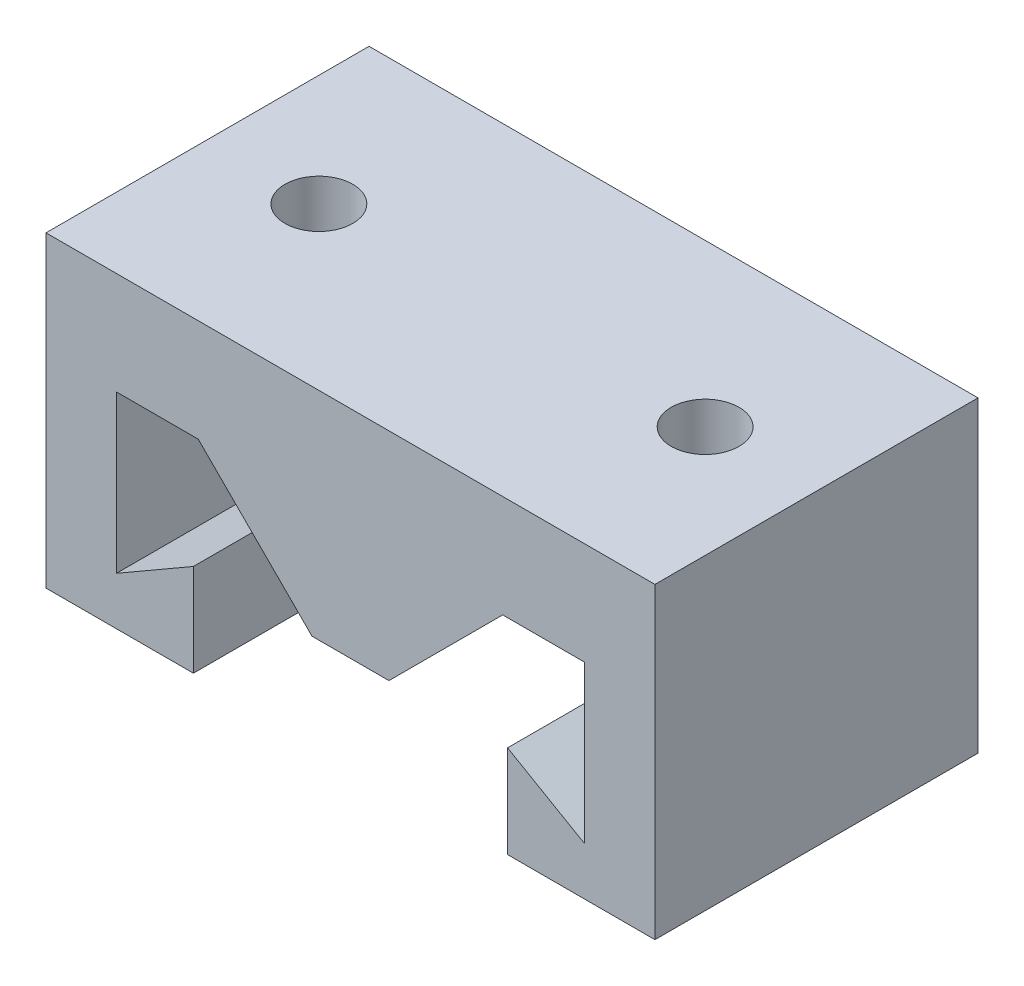
ISO-10303-21;
HEADER;
FILE_DESCRIPTION(('STEP AP214'),'2;1');
FILE_NAME('part.step','',(''),(''),'','','');
FILE_SCHEMA(('AUTOMOTIVE_DESIGN { 1 0 10303 214 1 1 1 1 }'));
ENDSEC;
DATA;
#1=APPLICATION_CONTEXT('core data for automotive mechanical design processes');
#2=APPLICATION_PROTOCOL_DEFINITION('international standard','automotive_design',2000,#1);
#3=PRODUCT_CONTEXT('',#1,'mechanical');
#4=PRODUCT('Part','Part','',(#3));
#5=PRODUCT_RELATED_PRODUCT_CATEGORY('part','',(#4));
#6=PRODUCT_DEFINITION_FORMATION('','',#4);
#7=PRODUCT_DEFINITION_CONTEXT('part definition',#1,'design');
#8=PRODUCT_DEFINITION('design','',#6,#7);
#9=PRODUCT_DEFINITION_SHAPE('','',#8);
#10=(LENGTH_UNIT() NAMED_UNIT(*) SI_UNIT(.MILLI.,.METRE.));
#11=(NAMED_UNIT(*) PLANE_ANGLE_UNIT() SI_UNIT($,.RADIAN.));
#12=(NAMED_UNIT(*) SI_UNIT($,.STERADIAN.) SOLID_ANGLE_UNIT());
#13=UNCERTAINTY_MEASURE_WITH_UNIT(LENGTH_MEASURE(1.E-05),#10,'distance_accuracy_value','');
#14=(GEOMETRIC_REPRESENTATION_CONTEXT(3) GLOBAL_UNCERTAINTY_ASSIGNED_CONTEXT((#13)) GLOBAL_UNIT_ASSIGNED_CONTEXT((#10,
#11,#12)) REPRESENTATION_CONTEXT('',''));
#15=CARTESIAN_POINT('',(0.,0.,0.));
#16=DIRECTION('',(0.,0.,1.));
#17=DIRECTION('',(1.,0.,0.));
#18=AXIS2_PLACEMENT_3D('',#15,#16,#17);
#19=CARTESIAN_POINT('',(-19.05,0.,10.));
#20=DIRECTION('',(0.,1.,0.));
#21=DIRECTION('',(-1.,0.,0.));
#22=AXIS2_PLACEMENT_3D('',#19,#20,#21);
#23=PLANE('',#22);
#24=DIRECTION('',(1.,0.,0.));
#25=VECTOR('',#24,1.);
#26=CARTESIAN_POINT('',(-19.05,0.,10.));
#27=LINE('',#26,#25);
#28=CARTESIAN_POINT('',(-18.85,0.,10.));
#29=VERTEX_POINT('',#28);
#30=CARTESIAN_POINT('',(-9.72500000000002,0.,10.));
#31=VERTEX_POINT('',#30);
#32=EDGE_CURVE('E158',#29,#31,#27,.T.);
#33=ORIENTED_EDGE('',*,*,#32,.F.);
#34=DIRECTION('',(0.,0.,1.));
#35=VECTOR('',#34,1.);
#36=CARTESIAN_POINT('',(-18.85,0.,-10.));
#37=LINE('',#36,#35);
#38=CARTESIAN_POINT('',(-18.85,0.,-10.));
#39=VERTEX_POINT('',#38);
#40=EDGE_CURVE('E146',#39,#29,#37,.T.);
#41=ORIENTED_EDGE('',*,*,#40,.F.);
#42=DIRECTION('',(1.,0.,0.));
#43=VECTOR('',#42,1.);
#44=CARTESIAN_POINT('',(-19.05,0.,-10.));
#45=LINE('',#44,#43);
#46=CARTESIAN_POINT('',(-9.72500000000002,0.,-10.));
#47=VERTEX_POINT('',#46);
#48=EDGE_CURVE('E202',#39,#47,#45,.T.);
#49=ORIENTED_EDGE('',*,*,#48,.T.);
#50=DIRECTION('',(0.,0.,-1.));
#51=VECTOR('',#50,1.);
#52=CARTESIAN_POINT('',(-9.72500000000002,0.,10.));
#53=LINE('',#52,#51);
#54=EDGE_CURVE('E11',#31,#47,#53,.T.);
#55=ORIENTED_EDGE('',*,*,#54,.F.);
#56=EDGE_LOOP('',(#33,#41,#49,#55));
#57=FACE_BOUND('',#56,.T.);
#58=ADVANCED_FACE('F36',(#57),#23,.F.);
#59=CARTESIAN_POINT('',(-9.72500000000002,0.,10.));
#60=DIRECTION('',(-1.,0.,0.));
#61=DIRECTION('',(0.,-1.,0.));
#62=AXIS2_PLACEMENT_3D('',#59,#60,#61);
#63=PLANE('',#62);
#64=DIRECTION('',(0.,1.,0.));
#65=VECTOR('',#64,1.);
#66=CARTESIAN_POINT('',(-9.72500000000002,0.,-10.));
#67=LINE('',#66,#65);
#68=CARTESIAN_POINT('',(-9.72500000000001,5.72463065701563,-10.));
#69=VERTEX_POINT('',#68);
#70=EDGE_CURVE('E204',#47,#69,#67,.T.);
#71=ORIENTED_EDGE('',*,*,#70,.T.);
#72=DIRECTION('',(0.,0.,-1.));
#73=VECTOR('',#72,1.);
#74=CARTESIAN_POINT('',(-9.72500000000001,5.72463065701563,10.));
#75=LINE('',#74,#73);
#76=CARTESIAN_POINT('',(-9.72500000000001,5.72463065701563,10.));
#77=VERTEX_POINT('',#76);
#78=EDGE_CURVE('E43',#77,#69,#75,.T.);
#79=ORIENTED_EDGE('',*,*,#78,.F.);
#80=DIRECTION('',(0.,1.,0.));
#81=VECTOR('',#80,1.);
#82=CARTESIAN_POINT('',(-9.72500000000002,0.,10.));
#83=LINE('',#82,#81);
#84=EDGE_CURVE('E166',#31,#77,#83,.T.);
#85=ORIENTED_EDGE('',*,*,#84,.F.);
#86=ORIENTED_EDGE('',*,*,#54,.T.);
#87=EDGE_LOOP('',(#71,#79,#85,#86));
#88=FACE_BOUND('',#87,.T.);
#89=ADVANCED_FACE('F281',(#88),#63,.F.);
#90=CARTESIAN_POINT('',(-9.72500000000001,5.72463065701563,10.));
#91=DIRECTION('',(0.500000000000004,-0.866025403784436,0.));
#92=DIRECTION('',(0.866025403784436,0.500000000000004,0.));
#93=AXIS2_PLACEMENT_3D('',#90,#91,#92);
#94=PLANE('',#93);
#95=DIRECTION('',(-0.866025403784436,-0.500000000000004,0.));
#96=VECTOR('',#95,1.);
#97=CARTESIAN_POINT('',(-9.72500000000001,5.72463065701563,-10.));
#98=LINE('',#97,#96);
#99=CARTESIAN_POINT('',(-14.4875,2.975,-10.));
#100=VERTEX_POINT('',#99);
#101=EDGE_CURVE('E207',#69,#100,#98,.T.);
#102=ORIENTED_EDGE('',*,*,#101,.T.);
#103=DIRECTION('',(0.,0.,-1.));
#104=VECTOR('',#103,1.);
#105=CARTESIAN_POINT('',(-14.4875,2.975,10.));
#106=LINE('',#105,#104);
#107=CARTESIAN_POINT('',(-14.4875,2.975,10.));
#108=VERTEX_POINT('',#107);
#109=EDGE_CURVE('E255',#108,#100,#106,.T.);
#110=ORIENTED_EDGE('',*,*,#109,.F.);
#111=DIRECTION('',(-0.866025403784436,-0.500000000000004,0.));
#112=VECTOR('',#111,1.);
#113=CARTESIAN_POINT('',(-9.72500000000001,5.72463065701563,10.));
#114=LINE('',#113,#112);
#115=EDGE_CURVE('E169',#77,#108,#114,.T.);
#116=ORIENTED_EDGE('',*,*,#115,.F.);
#117=ORIENTED_EDGE('',*,*,#78,.T.);
#118=EDGE_LOOP('',(#102,#110,#116,#117));
#119=FACE_BOUND('',#118,.T.);
#120=ADVANCED_FACE('F262',(#119),#94,.F.);
#121=CARTESIAN_POINT('',(-14.4875,2.975,10.));
#122=DIRECTION('',(-1.,0.,0.));
#123=DIRECTION('',(0.,0.,1.));
#124=AXIS2_PLACEMENT_3D('',#121,#122,#123);
#125=PLANE('',#124);
#126=DIRECTION('',(0.,1.,0.));
#127=VECTOR('',#126,1.);
#128=CARTESIAN_POINT('',(-14.4875,2.975,-10.));
#129=LINE('',#128,#127);
#130=CARTESIAN_POINT('',(-14.4875,12.7,-10.));
#131=VERTEX_POINT('',#130);
#132=EDGE_CURVE('E209',#100,#131,#129,.T.);
#133=ORIENTED_EDGE('',*,*,#132,.T.);
#134=DIRECTION('',(0.,0.,-1.));
#135=VECTOR('',#134,1.);
#136=CARTESIAN_POINT('',(-14.4875,12.7,10.));
#137=LINE('',#136,#135);
#138=CARTESIAN_POINT('',(-14.4875,12.7,10.));
#139=VERTEX_POINT('',#138);
#140=EDGE_CURVE('E252',#139,#131,#137,.T.);
#141=ORIENTED_EDGE('',*,*,#140,.F.);
#142=DIRECTION('',(0.,1.,0.));
#143=VECTOR('',#142,1.);
#144=CARTESIAN_POINT('',(-14.4875,2.975,10.));
#145=LINE('',#144,#143);
#146=EDGE_CURVE('E179',#108,#139,#145,.T.);
#147=ORIENTED_EDGE('',*,*,#146,.F.);
#148=ORIENTED_EDGE('',*,*,#109,.T.);
#149=EDGE_LOOP('',(#133,#141,#147,#148));
#150=FACE_BOUND('',#149,.T.);
#151=ADVANCED_FACE('F273',(#150),#125,.F.);
#152=CARTESIAN_POINT('',(-14.4875,12.7,10.));
#153=DIRECTION('',(0.,1.,0.));
#154=DIRECTION('',(0.,0.,1.));
#155=AXIS2_PLACEMENT_3D('',#152,#153,#154);
#156=PLANE('',#155);
#157=CARTESIAN_POINT('',(-11.95625,12.7,0.));
#158=DIRECTION('',(0.,1.,0.));
#159=DIRECTION('',(0.,0.,1.));
#160=AXIS2_PLACEMENT_3D('',#157,#158,#159);
#161=CIRCLE('',#160,2.1);
#162=CARTESIAN_POINT('',(-11.95625,12.7,2.1));
#163=VERTEX_POINT('',#162);
#164=EDGE_CURVE('E205',#163,#163,#161,.F.);
#165=ORIENTED_EDGE('',*,*,#164,.F.);
#166=EDGE_LOOP('',(#165));
#167=FACE_BOUND('',#166,.T.);
#168=DIRECTION('',(1.,0.,0.));
#169=VECTOR('',#168,1.);
#170=CARTESIAN_POINT('',(-14.4875,12.7,-10.));
#171=LINE('',#170,#169);
#172=CARTESIAN_POINT('',(-9.425,12.7,-10.));
#173=VERTEX_POINT('',#172);
#174=EDGE_CURVE('E211',#131,#173,#171,.T.);
#175=ORIENTED_EDGE('',*,*,#174,.T.);
#176=DIRECTION('',(0.,0.,-1.));
#177=VECTOR('',#176,1.);
#178=CARTESIAN_POINT('',(-9.425,12.7,10.));
#179=LINE('',#178,#177);
#180=CARTESIAN_POINT('',(-9.425,12.7,10.));
#181=VERTEX_POINT('',#180);
#182=EDGE_CURVE('E249',#181,#173,#179,.T.);
#183=ORIENTED_EDGE('',*,*,#182,.F.);
#184=DIRECTION('',(1.,0.,0.));
#185=VECTOR('',#184,1.);
#186=CARTESIAN_POINT('',(-14.4875,12.7,10.));
#187=LINE('',#186,#185);
#188=EDGE_CURVE('E181',#139,#181,#187,.T.);
#189=ORIENTED_EDGE('',*,*,#188,.F.);
#190=ORIENTED_EDGE('',*,*,#140,.T.);
#191=EDGE_LOOP('',(#175,#183,#189,#190));
#192=FACE_BOUND('',#191,.T.);
#193=ADVANCED_FACE('F277',(#167,#192),#156,.F.);
#194=CARTESIAN_POINT('',(-9.425,12.7,10.));
#195=DIRECTION('',(0.707106781186549,0.707106781186546,0.));
#196=DIRECTION('',(-0.707106781186546,0.707106781186549,0.));
#197=AXIS2_PLACEMENT_3D('',#194,#195,#196);
#198=PLANE('',#197);
#199=DIRECTION('',(0.707106781186546,-0.707106781186549,0.));
#200=VECTOR('',#199,1.);
#201=CARTESIAN_POINT('',(-9.425,12.7,-10.));
#202=LINE('',#201,#200);
#203=CARTESIAN_POINT('',(-2.38125,5.65624999999998,-10.));
#204=VERTEX_POINT('',#203);
#205=EDGE_CURVE('E213',#173,#204,#202,.T.);
#206=ORIENTED_EDGE('',*,*,#205,.T.);
#207=DIRECTION('',(0.,0.,-1.));
#208=VECTOR('',#207,1.);
#209=CARTESIAN_POINT('',(-2.38125,5.65624999999998,10.));
#210=LINE('',#209,#208);
#211=CARTESIAN_POINT('',(-2.38125,5.65624999999998,10.));
#212=VERTEX_POINT('',#211);
#213=EDGE_CURVE('E246',#212,#204,#210,.T.);
#214=ORIENTED_EDGE('',*,*,#213,.F.);
#215=DIRECTION('',(0.707106781186546,-0.707106781186549,0.));
#216=VECTOR('',#215,1.);
#217=CARTESIAN_POINT('',(-9.425,12.7,10.));
#218=LINE('',#217,#216);
#219=EDGE_CURVE('E183',#181,#212,#218,.T.);
#220=ORIENTED_EDGE('',*,*,#219,.F.);
#221=ORIENTED_EDGE('',*,*,#182,.T.);
#222=EDGE_LOOP('',(#206,#214,#220,#221));
#223=FACE_BOUND('',#222,.T.);
#224=ADVANCED_FACE('F294',(#223),#198,.F.);
#225=CARTESIAN_POINT('',(-2.38125,5.65624999999998,10.));
#226=DIRECTION('',(0.,1.,0.));
#227=DIRECTION('',(0.,0.,1.));
#228=AXIS2_PLACEMENT_3D('',#225,#226,#227);
#229=PLANE('',#228);
#230=DIRECTION('',(1.,0.,0.));
#231=VECTOR('',#230,1.);
#232=CARTESIAN_POINT('',(-2.38125,5.65624999999998,-10.));
#233=LINE('',#232,#231);
#234=CARTESIAN_POINT('',(2.38125,5.65624999999998,-10.));
#235=VERTEX_POINT('',#234);
#236=EDGE_CURVE('E215',#204,#235,#233,.T.);
#237=ORIENTED_EDGE('',*,*,#236,.T.);
#238=DIRECTION('',(0.,0.,-1.));
#239=VECTOR('',#238,1.);
#240=CARTESIAN_POINT('',(2.38125,5.65624999999998,10.));
#241=LINE('',#240,#239);
#242=CARTESIAN_POINT('',(2.38125,5.65624999999998,10.));
#243=VERTEX_POINT('',#242);
#244=EDGE_CURVE('E243',#243,#235,#241,.T.);
#245=ORIENTED_EDGE('',*,*,#244,.F.);
#246=DIRECTION('',(1.,0.,0.));
#247=VECTOR('',#246,1.);
#248=CARTESIAN_POINT('',(-2.38125,5.65624999999998,10.));
#249=LINE('',#248,#247);
#250=EDGE_CURVE('E185',#212,#243,#249,.T.);
#251=ORIENTED_EDGE('',*,*,#250,.F.);
#252=ORIENTED_EDGE('',*,*,#213,.T.);
#253=EDGE_LOOP('',(#237,#245,#251,#252));
#254=FACE_BOUND('',#253,.T.);
#255=ADVANCED_FACE('F298',(#254),#229,.F.);
#256=CARTESIAN_POINT('',(2.38125,5.65624999999998,10.));
#257=DIRECTION('',(-0.707106781186549,0.707106781186546,0.));
#258=DIRECTION('',(-0.707106781186546,-0.707106781186549,0.));
#259=AXIS2_PLACEMENT_3D('',#256,#257,#258);
#260=PLANE('',#259);
#261=DIRECTION('',(0.707106781186546,0.707106781186549,0.));
#262=VECTOR('',#261,1.);
#263=CARTESIAN_POINT('',(2.38125,5.65624999999998,-10.));
#264=LINE('',#263,#262);
#265=CARTESIAN_POINT('',(9.425,12.7,-10.));
#266=VERTEX_POINT('',#265);
#267=EDGE_CURVE('E217',#235,#266,#264,.T.);
#268=ORIENTED_EDGE('',*,*,#267,.T.);
#269=DIRECTION('',(0.,0.,-1.));
#270=VECTOR('',#269,1.);
#271=CARTESIAN_POINT('',(9.425,12.7,10.));
#272=LINE('',#271,#270);
#273=CARTESIAN_POINT('',(9.425,12.7,10.));
#274=VERTEX_POINT('',#273);
#275=EDGE_CURVE('E240',#274,#266,#272,.T.);
#276=ORIENTED_EDGE('',*,*,#275,.F.);
#277=DIRECTION('',(0.707106781186546,0.707106781186549,0.));
#278=VECTOR('',#277,1.);
#279=CARTESIAN_POINT('',(2.38125,5.65624999999998,10.));
#280=LINE('',#279,#278);
#281=EDGE_CURVE('E187',#243,#274,#280,.T.);
#282=ORIENTED_EDGE('',*,*,#281,.F.);
#283=ORIENTED_EDGE('',*,*,#244,.T.);
#284=EDGE_LOOP('',(#268,#276,#282,#283));
#285=FACE_BOUND('',#284,.T.);
#286=ADVANCED_FACE('F302',(#285),#260,.F.);
#287=CARTESIAN_POINT('',(9.425,12.7,10.));
#288=DIRECTION('',(0.,1.,0.));
#289=DIRECTION('',(-1.,0.,0.));
#290=AXIS2_PLACEMENT_3D('',#287,#288,#289);
#291=PLANE('',#290);
#292=CARTESIAN_POINT('',(11.95625,12.7,0.));
#293=DIRECTION('',(0.,1.,0.));
#294=DIRECTION('',(0.,0.,1.));
#295=AXIS2_PLACEMENT_3D('',#292,#293,#294);
#296=CIRCLE('',#295,2.1);
#297=CARTESIAN_POINT('',(11.95625,12.7,2.1));
#298=VERTEX_POINT('',#297);
#299=EDGE_CURVE('E513',#298,#298,#296,.F.);
#300=ORIENTED_EDGE('',*,*,#299,.F.);
#301=EDGE_LOOP('',(#300));
#302=FACE_BOUND('',#301,.T.);
#303=DIRECTION('',(1.,0.,0.));
#304=VECTOR('',#303,1.);
#305=CARTESIAN_POINT('',(9.425,12.7,-10.));
#306=LINE('',#305,#304);
#307=CARTESIAN_POINT('',(14.4875,12.7,-10.));
#308=VERTEX_POINT('',#307);
#309=EDGE_CURVE('E219',#266,#308,#306,.T.);
#310=ORIENTED_EDGE('',*,*,#309,.T.);
#311=DIRECTION('',(0.,0.,-1.));
#312=VECTOR('',#311,1.);
#313=CARTESIAN_POINT('',(14.4875,12.7,10.));
#314=LINE('',#313,#312);
#315=CARTESIAN_POINT('',(14.4875,12.7,10.));
#316=VERTEX_POINT('',#315);
#317=EDGE_CURVE('E237',#316,#308,#314,.T.);
#318=ORIENTED_EDGE('',*,*,#317,.F.);
#319=DIRECTION('',(1.,0.,0.));
#320=VECTOR('',#319,1.);
#321=CARTESIAN_POINT('',(9.425,12.7,10.));
#322=LINE('',#321,#320);
#323=EDGE_CURVE('E189',#274,#316,#322,.T.);
#324=ORIENTED_EDGE('',*,*,#323,.F.);
#325=ORIENTED_EDGE('',*,*,#275,.T.);
#326=EDGE_LOOP('',(#310,#318,#324,#325));
#327=FACE_BOUND('',#326,.T.);
#328=ADVANCED_FACE('F306',(#302,#327),#291,.F.);
#329=CARTESIAN_POINT('',(14.4875,12.7,10.));
#330=DIRECTION('',(1.,0.,0.));
#331=DIRECTION('',(0.,0.,-1.));
#332=AXIS2_PLACEMENT_3D('',#329,#330,#331);
#333=PLANE('',#332);
#334=DIRECTION('',(0.,-1.,0.));
#335=VECTOR('',#334,1.);
#336=CARTESIAN_POINT('',(14.4875,12.7,-10.));
#337=LINE('',#336,#335);
#338=CARTESIAN_POINT('',(14.4875,2.97500000000001,-10.));
#339=VERTEX_POINT('',#338);
#340=EDGE_CURVE('E221',#308,#339,#337,.T.);
#341=ORIENTED_EDGE('',*,*,#340,.T.);
#342=DIRECTION('',(0.,0.,-1.));
#343=VECTOR('',#342,1.);
#344=CARTESIAN_POINT('',(14.4875,2.97500000000001,10.));
#345=LINE('',#344,#343);
#346=CARTESIAN_POINT('',(14.4875,2.97500000000001,10.));
#347=VERTEX_POINT('',#346);
#348=EDGE_CURVE('E234',#347,#339,#345,.T.);
#349=ORIENTED_EDGE('',*,*,#348,.F.);
#350=DIRECTION('',(0.,-1.,0.));
#351=VECTOR('',#350,1.);
#352=CARTESIAN_POINT('',(14.4875,12.7,10.));
#353=LINE('',#352,#351);
#354=EDGE_CURVE('E191',#316,#347,#353,.T.);
#355=ORIENTED_EDGE('',*,*,#354,.F.);
#356=ORIENTED_EDGE('',*,*,#317,.T.);
#357=EDGE_LOOP('',(#341,#349,#355,#356));
#358=FACE_BOUND('',#357,.T.);
#359=ADVANCED_FACE('F310',(#358),#333,.F.);
#360=CARTESIAN_POINT('',(14.4875,2.97500000000001,10.));
#361=DIRECTION('',(-0.500000000000004,-0.866025403784437,0.));
#362=DIRECTION('',(0.866025403784437,-0.500000000000004,0.));
#363=AXIS2_PLACEMENT_3D('',#360,#361,#362);
#364=PLANE('',#363);
#365=DIRECTION('',(-0.866025403784437,0.500000000000004,0.));
#366=VECTOR('',#365,1.);
#367=CARTESIAN_POINT('',(14.4875,2.97500000000001,-10.));
#368=LINE('',#367,#366);
#369=CARTESIAN_POINT('',(9.72500000000002,5.72463065701563,-10.));
#370=VERTEX_POINT('',#369);
#371=EDGE_CURVE('E223',#339,#370,#368,.T.);
#372=ORIENTED_EDGE('',*,*,#371,.T.);
#373=DIRECTION('',(0.,0.,-1.));
#374=VECTOR('',#373,1.);
#375=CARTESIAN_POINT('',(9.72500000000002,5.72463065701563,10.));
#376=LINE('',#375,#374);
#377=CARTESIAN_POINT('',(9.72500000000002,5.72463065701563,10.));
#378=VERTEX_POINT('',#377);
#379=EDGE_CURVE('E231',#378,#370,#376,.T.);
#380=ORIENTED_EDGE('',*,*,#379,.F.);
#381=DIRECTION('',(-0.866025403784437,0.500000000000004,0.));
#382=VECTOR('',#381,1.);
#383=CARTESIAN_POINT('',(14.4875,2.97500000000001,10.));
#384=LINE('',#383,#382);
#385=EDGE_CURVE('E193',#347,#378,#384,.T.);
#386=ORIENTED_EDGE('',*,*,#385,.F.);
#387=ORIENTED_EDGE('',*,*,#348,.T.);
#388=EDGE_LOOP('',(#372,#380,#386,#387));
#389=FACE_BOUND('',#388,.T.);
#390=ADVANCED_FACE('F314',(#389),#364,.F.);
#391=CARTESIAN_POINT('',(9.72500000000002,5.72463065701563,10.));
#392=DIRECTION('',(1.,0.,0.));
#393=DIRECTION('',(0.,0.,-1.));
#394=AXIS2_PLACEMENT_3D('',#391,#392,#393);
#395=PLANE('',#394);
#396=DIRECTION('',(0.,-1.,0.));
#397=VECTOR('',#396,1.);
#398=CARTESIAN_POINT('',(9.72500000000002,5.72463065701563,-10.));
#399=LINE('',#398,#397);
#400=CARTESIAN_POINT('',(9.72500000000002,0.,-10.));
#401=VERTEX_POINT('',#400);
#402=EDGE_CURVE('E225',#370,#401,#399,.T.);
#403=ORIENTED_EDGE('',*,*,#402,.T.);
#404=DIRECTION('',(0.,0.,-1.));
#405=VECTOR('',#404,1.);
#406=CARTESIAN_POINT('',(9.72500000000002,0.,10.));
#407=LINE('',#406,#405);
#408=CARTESIAN_POINT('',(9.72500000000002,0.,10.));
#409=VERTEX_POINT('',#408);
#410=EDGE_CURVE('E201',#409,#401,#407,.T.);
#411=ORIENTED_EDGE('',*,*,#410,.F.);
#412=DIRECTION('',(0.,-1.,0.));
#413=VECTOR('',#412,1.);
#414=CARTESIAN_POINT('',(9.72500000000002,5.72463065701563,10.));
#415=LINE('',#414,#413);
#416=EDGE_CURVE('E195',#378,#409,#415,.T.);
#417=ORIENTED_EDGE('',*,*,#416,.F.);
#418=ORIENTED_EDGE('',*,*,#379,.T.);
#419=EDGE_LOOP('',(#403,#411,#417,#418));
#420=FACE_BOUND('',#419,.T.);
#421=ADVANCED_FACE('F318',(#420),#395,.F.);
#422=CARTESIAN_POINT('',(9.72500000000002,0.,10.));
#423=DIRECTION('',(0.,1.,0.));
#424=DIRECTION('',(-1.,0.,0.));
#425=AXIS2_PLACEMENT_3D('',#422,#423,#424);
#426=PLANE('',#425);
#427=DIRECTION('',(1.,0.,0.));
#428=VECTOR('',#427,1.);
#429=CARTESIAN_POINT('',(9.72500000000002,0.,-10.));
#430=LINE('',#429,#428);
#431=CARTESIAN_POINT('',(18.85,0.,-10.));
#432=VERTEX_POINT('',#431);
#433=EDGE_CURVE('E172',#401,#432,#430,.T.);
#434=ORIENTED_EDGE('',*,*,#433,.T.);
#435=DIRECTION('',(0.,0.,1.));
#436=VECTOR('',#435,1.);
#437=CARTESIAN_POINT('',(18.85,0.,-10.));
#438=LINE('',#437,#436);
#439=CARTESIAN_POINT('',(18.85,0.,10.));
#440=VERTEX_POINT('',#439);
#441=EDGE_CURVE('E50',#432,#440,#438,.T.);
#442=ORIENTED_EDGE('',*,*,#441,.T.);
#443=DIRECTION('',(1.,0.,0.));
#444=VECTOR('',#443,1.);
#445=CARTESIAN_POINT('',(9.72500000000002,0.,10.));
#446=LINE('',#445,#444);
#447=EDGE_CURVE('E197',#409,#440,#446,.T.);
#448=ORIENTED_EDGE('',*,*,#447,.F.);
#449=ORIENTED_EDGE('',*,*,#410,.T.);
#450=EDGE_LOOP('',(#434,#442,#448,#449));
#451=FACE_BOUND('',#450,.T.);
#452=ADVANCED_FACE('F322',(#451),#426,.F.);
#453=CARTESIAN_POINT('',(-19.05,19.05,10.));
#454=DIRECTION('',(0.,-1.,0.));
#455=DIRECTION('',(0.,0.,-1.));
#456=AXIS2_PLACEMENT_3D('',#453,#454,#455);
#457=PLANE('',#456);
#458=CARTESIAN_POINT('',(-11.95625,19.05,0.));
#459=DIRECTION('',(0.,1.,0.));
#460=DIRECTION('',(-1.,0.,0.));
#461=AXIS2_PLACEMENT_3D('',#458,#459,#460);
#462=CIRCLE('',#461,2.1);
#463=CARTESIAN_POINT('',(-14.05625,19.05,0.));
#464=VERTEX_POINT('',#463);
#465=EDGE_CURVE('E509',#464,#464,#462,.T.);
#466=ORIENTED_EDGE('',*,*,#465,.F.);
#467=EDGE_LOOP('',(#466));
#468=FACE_BOUND('',#467,.T.);
#469=CARTESIAN_POINT('',(11.95625,19.05,0.));
#470=DIRECTION('',(0.,1.,0.));
#471=DIRECTION('',(-1.,0.,0.));
#472=AXIS2_PLACEMENT_3D('',#469,#470,#471);
#473=CIRCLE('',#472,2.1);
#474=CARTESIAN_POINT('',(9.85625000000002,19.05,0.));
#475=VERTEX_POINT('',#474);
#476=EDGE_CURVE('E175',#475,#475,#473,.T.);
#477=ORIENTED_EDGE('',*,*,#476,.F.);
#478=EDGE_LOOP('',(#477));
#479=FACE_BOUND('',#478,.T.);
#480=DIRECTION('',(-1.,0.,0.));
#481=VECTOR('',#480,1.);
#482=CARTESIAN_POINT('',(-19.05,19.05,-10.));
#483=LINE('',#482,#481);
#484=CARTESIAN_POINT('',(18.85,19.05,-10.));
#485=VERTEX_POINT('',#484);
#486=CARTESIAN_POINT('',(-18.85,19.05,-10.));
#487=VERTEX_POINT('',#486);
#488=EDGE_CURVE('E167',#485,#487,#483,.T.);
#489=ORIENTED_EDGE('',*,*,#488,.T.);
#490=DIRECTION('',(0.,0.,1.));
#491=VECTOR('',#490,1.);
#492=CARTESIAN_POINT('',(-18.85,19.05,-10.));
#493=LINE('',#492,#491);
#494=CARTESIAN_POINT('',(-18.85,19.05,10.));
#495=VERTEX_POINT('',#494);
#496=EDGE_CURVE('E58',#487,#495,#493,.T.);
#497=ORIENTED_EDGE('',*,*,#496,.T.);
#498=DIRECTION('',(-1.,0.,0.));
#499=VECTOR('',#498,1.);
#500=CARTESIAN_POINT('',(-19.05,19.05,10.));
#501=LINE('',#500,#499);
#502=CARTESIAN_POINT('',(18.85,19.05,10.));
#503=VERTEX_POINT('',#502);
#504=EDGE_CURVE('E162',#503,#495,#501,.T.);
#505=ORIENTED_EDGE('',*,*,#504,.F.);
#506=DIRECTION('',(0.,0.,1.));
#507=VECTOR('',#506,1.);
#508=CARTESIAN_POINT('',(18.85,19.05,-10.));
#509=LINE('',#508,#507);
#510=EDGE_CURVE('E522',#485,#503,#509,.T.);
#511=ORIENTED_EDGE('',*,*,#510,.F.);
#512=EDGE_LOOP('',(#489,#497,#505,#511));
#513=FACE_BOUND('',#512,.T.);
#514=ADVANCED_FACE('F326',(#468,#479,#513),#457,.F.);
#515=CARTESIAN_POINT('',(0.,0.,10.));
#516=DIRECTION('',(0.,0.,1.));
#517=DIRECTION('',(1.,0.,0.));
#518=AXIS2_PLACEMENT_3D('',#515,#516,#517);
#519=PLANE('',#518);
#520=DIRECTION('',(0.,1.,0.));
#521=VECTOR('',#520,1.);
#522=CARTESIAN_POINT('',(-18.85,0.,10.));
#523=LINE('',#522,#521);
#524=EDGE_CURVE('E149',#29,#495,#523,.T.);
#525=ORIENTED_EDGE('',*,*,#524,.F.);
#526=ORIENTED_EDGE('',*,*,#32,.T.);
#527=ORIENTED_EDGE('',*,*,#84,.T.);
#528=ORIENTED_EDGE('',*,*,#115,.T.);
#529=ORIENTED_EDGE('',*,*,#146,.T.);
#530=ORIENTED_EDGE('',*,*,#188,.T.);
#531=ORIENTED_EDGE('',*,*,#219,.T.);
#532=ORIENTED_EDGE('',*,*,#250,.T.);
#533=ORIENTED_EDGE('',*,*,#281,.T.);
#534=ORIENTED_EDGE('',*,*,#323,.T.);
#535=ORIENTED_EDGE('',*,*,#354,.T.);
#536=ORIENTED_EDGE('',*,*,#385,.T.);
#537=ORIENTED_EDGE('',*,*,#416,.T.);
#538=ORIENTED_EDGE('',*,*,#447,.T.);
#539=DIRECTION('',(0.,-1.,0.));
#540=VECTOR('',#539,1.);
#541=CARTESIAN_POINT('',(18.85,0.,10.));
#542=LINE('',#541,#540);
#543=EDGE_CURVE('E163',#503,#440,#542,.T.);
#544=ORIENTED_EDGE('',*,*,#543,.F.);
#545=ORIENTED_EDGE('',*,*,#504,.T.);
#546=EDGE_LOOP('',(#525,#526,#527,#528,#529,#530,#531,#532,#533,#534,#535,#536,#537,#538,#544,#545));
#547=FACE_BOUND('',#546,.T.);
#548=ADVANCED_FACE('F157',(#547),#519,.T.);
#549=CARTESIAN_POINT('',(0.,0.,-10.));
#550=DIRECTION('',(0.,0.,1.));
#551=DIRECTION('',(1.,0.,0.));
#552=AXIS2_PLACEMENT_3D('',#549,#550,#551);
#553=PLANE('',#552);
#554=ORIENTED_EDGE('',*,*,#48,.F.);
#555=DIRECTION('',(0.,1.,0.));
#556=VECTOR('',#555,1.);
#557=CARTESIAN_POINT('',(-18.85,0.,-10.));
#558=LINE('',#557,#556);
#559=EDGE_CURVE('E150',#39,#487,#558,.T.);
#560=ORIENTED_EDGE('',*,*,#559,.T.);
#561=ORIENTED_EDGE('',*,*,#488,.F.);
#562=DIRECTION('',(0.,-1.,0.));
#563=VECTOR('',#562,1.);
#564=CARTESIAN_POINT('',(18.85,0.,-10.));
#565=LINE('',#564,#563);
#566=EDGE_CURVE('E524',#485,#432,#565,.T.);
#567=ORIENTED_EDGE('',*,*,#566,.T.);
#568=ORIENTED_EDGE('',*,*,#433,.F.);
#569=ORIENTED_EDGE('',*,*,#402,.F.);
#570=ORIENTED_EDGE('',*,*,#371,.F.);
#571=ORIENTED_EDGE('',*,*,#340,.F.);
#572=ORIENTED_EDGE('',*,*,#309,.F.);
#573=ORIENTED_EDGE('',*,*,#267,.F.);
#574=ORIENTED_EDGE('',*,*,#236,.F.);
#575=ORIENTED_EDGE('',*,*,#205,.F.);
#576=ORIENTED_EDGE('',*,*,#174,.F.);
#577=ORIENTED_EDGE('',*,*,#132,.F.);
#578=ORIENTED_EDGE('',*,*,#101,.F.);
#579=ORIENTED_EDGE('',*,*,#70,.F.);
#580=EDGE_LOOP('',(#554,#560,#561,#567,#568,#569,#570,#571,#572,#573,#574,#575,#576,#577,#578,#579));
#581=FACE_BOUND('',#580,.T.);
#582=ADVANCED_FACE('F268',(#581),#553,.F.);
#583=CARTESIAN_POINT('',(11.95625,6.760303038033,0.));
#584=DIRECTION('',(0.,1.,0.));
#585=DIRECTION('',(-1.,0.,0.));
#586=AXIS2_PLACEMENT_3D('',#583,#584,#585);
#587=CYLINDRICAL_SURFACE('',#586,2.1);
#588=ORIENTED_EDGE('',*,*,#299,.T.);
#589=EDGE_LOOP('',(#588));
#590=FACE_BOUND('',#589,.T.);
#591=ORIENTED_EDGE('',*,*,#476,.T.);
#592=EDGE_LOOP('',(#591));
#593=FACE_BOUND('',#592,.T.);
#594=ADVANCED_FACE('F333',(#590,#593),#587,.F.);
#595=CARTESIAN_POINT('',(-11.95625,6.760303038033,0.));
#596=DIRECTION('',(0.,1.,0.));
#597=DIRECTION('',(-1.,0.,0.));
#598=AXIS2_PLACEMENT_3D('',#595,#596,#597);
#599=CYLINDRICAL_SURFACE('',#598,2.1);
#600=ORIENTED_EDGE('',*,*,#164,.T.);
#601=EDGE_LOOP('',(#600));
#602=FACE_BOUND('',#601,.T.);
#603=ORIENTED_EDGE('',*,*,#465,.T.);
#604=EDGE_LOOP('',(#603));
#605=FACE_BOUND('',#604,.T.);
#606=ADVANCED_FACE('F338',(#602,#605),#599,.F.);
#607=CARTESIAN_POINT('',(18.85,0.,-10.));
#608=DIRECTION('',(-1.,0.,0.));
#609=DIRECTION('',(0.,0.,1.));
#610=AXIS2_PLACEMENT_3D('',#607,#608,#609);
#611=PLANE('',#610);
#612=ORIENTED_EDGE('',*,*,#441,.F.);
#613=ORIENTED_EDGE('',*,*,#566,.F.);
#614=ORIENTED_EDGE('',*,*,#510,.T.);
#615=ORIENTED_EDGE('',*,*,#543,.T.);
#616=EDGE_LOOP('',(#612,#613,#614,#615));
#617=FACE_BOUND('',#616,.T.);
#618=ADVANCED_FACE('F342',(#617),#611,.F.);
#619=CARTESIAN_POINT('',(-18.85,0.,-10.));
#620=DIRECTION('',(1.,0.,0.));
#621=DIRECTION('',(0.,0.,-1.));
#622=AXIS2_PLACEMENT_3D('',#619,#620,#621);
#623=PLANE('',#622);
#624=ORIENTED_EDGE('',*,*,#496,.F.);
#625=ORIENTED_EDGE('',*,*,#559,.F.);
#626=ORIENTED_EDGE('',*,*,#40,.T.);
#627=ORIENTED_EDGE('',*,*,#524,.T.);
#628=EDGE_LOOP('',(#624,#625,#626,#627));
#629=FACE_BOUND('',#628,.T.);
#630=ADVANCED_FACE('F148',(#629),#623,.F.);
#631=CLOSED_SHELL('',(#58,#89,#120,#151,#193,#224,#255,#286,#328,#359,#390,#421,#452,#514,#548,
#582,#594,#606,#618,#630));
#632=MANIFOLD_SOLID_BREP('B2',#631);
#633=ADVANCED_BREP_SHAPE_REPRESENTATION('',(#18,#632),#14);
#634=SHAPE_DEFINITION_REPRESENTATION(#9,#633);
ENDSEC;
END-ISO-10303-21;
